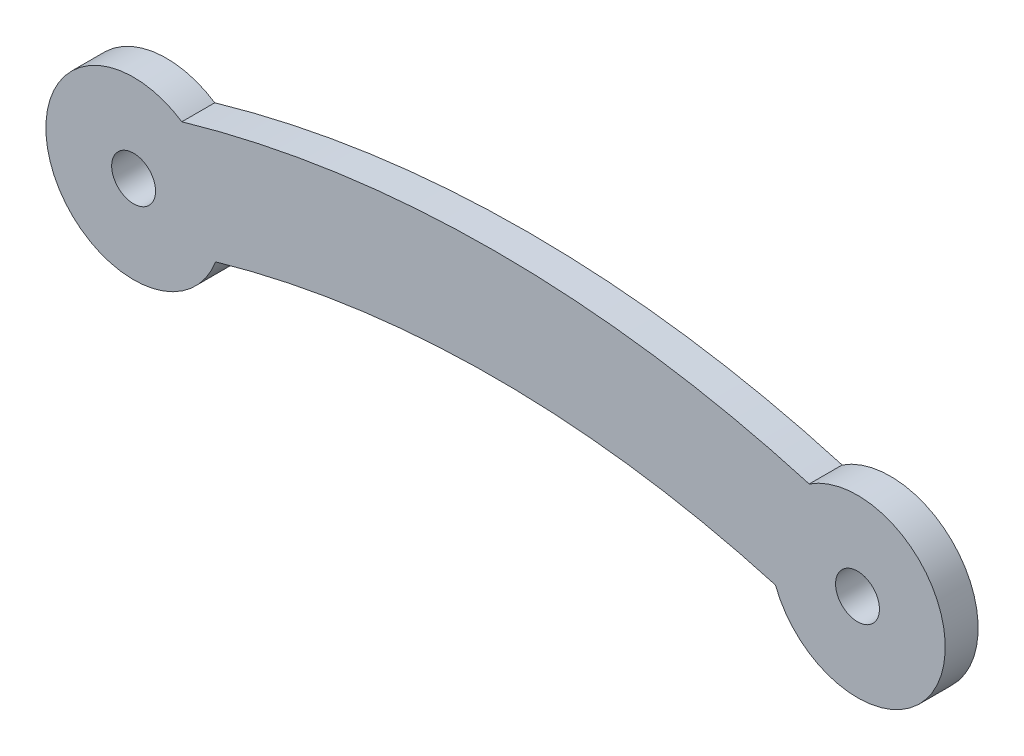
ISO-10303-21;
HEADER;
FILE_DESCRIPTION(('STEP AP214'),'2;1');
FILE_NAME('part.step','',(''),(''),'','','');
FILE_SCHEMA(('AUTOMOTIVE_DESIGN { 1 0 10303 214 1 1 1 1 }'));
ENDSEC;
DATA;
#1=APPLICATION_CONTEXT('core data for automotive mechanical design processes');
#2=APPLICATION_PROTOCOL_DEFINITION('international standard','automotive_design',2000,#1);
#3=PRODUCT_CONTEXT('',#1,'mechanical');
#4=PRODUCT('Part','Part','',(#3));
#5=PRODUCT_RELATED_PRODUCT_CATEGORY('part','',(#4));
#6=PRODUCT_DEFINITION_FORMATION('','',#4);
#7=PRODUCT_DEFINITION_CONTEXT('part definition',#1,'design');
#8=PRODUCT_DEFINITION('design','',#6,#7);
#9=PRODUCT_DEFINITION_SHAPE('','',#8);
#10=(LENGTH_UNIT() NAMED_UNIT(*) SI_UNIT(.MILLI.,.METRE.));
#11=(NAMED_UNIT(*) PLANE_ANGLE_UNIT() SI_UNIT($,.RADIAN.));
#12=(NAMED_UNIT(*) SI_UNIT($,.STERADIAN.) SOLID_ANGLE_UNIT());
#13=UNCERTAINTY_MEASURE_WITH_UNIT(LENGTH_MEASURE(1.E-05),#10,'distance_accuracy_value','');
#14=(GEOMETRIC_REPRESENTATION_CONTEXT(3) GLOBAL_UNCERTAINTY_ASSIGNED_CONTEXT((#13)) GLOBAL_UNIT_ASSIGNED_CONTEXT((#10,
#11,#12)) REPRESENTATION_CONTEXT('',''));
#15=CARTESIAN_POINT('',(0.,0.,0.));
#16=DIRECTION('',(0.,0.,1.));
#17=DIRECTION('',(1.,0.,0.));
#18=AXIS2_PLACEMENT_3D('',#15,#16,#17);
#19=CARTESIAN_POINT('',(24.75,-22.9622545969357,1.5));
#20=DIRECTION('',(0.,0.,-1.));
#21=DIRECTION('',(-1.,0.,0.));
#22=AXIS2_PLACEMENT_3D('',#19,#20,#21);
#23=PLANE('',#22);
#24=CARTESIAN_POINT('',(16.5,-45.9245091938713,1.5));
#25=DIRECTION('',(0.,0.,1.));
#26=DIRECTION('',(-1.,0.,0.));
#27=AXIS2_PLACEMENT_3D('',#24,#25,#26);
#28=CIRCLE('',#27,51.2986735956826);
#29=CARTESIAN_POINT('',(30.8000765160621,3.34070900630672,1.5));
#30=VERTEX_POINT('',#29);
#31=CARTESIAN_POINT('',(2.19992348393783,3.34070900630671,1.5));
#32=VERTEX_POINT('',#31);
#33=EDGE_CURVE('E92',#30,#32,#28,.T.);
#34=ORIENTED_EDGE('',*,*,#33,.T.);
#35=CARTESIAN_POINT('',(0.,0.,1.5));
#36=DIRECTION('',(0.,0.,1.));
#37=DIRECTION('',(1.,0.,0.));
#38=AXIS2_PLACEMENT_3D('',#35,#36,#37);
#39=CIRCLE('',#38,3.99999999999999);
#40=CARTESIAN_POINT('',(3.73986997405074,-1.41893360563263,1.5));
#41=VERTEX_POINT('',#40);
#42=EDGE_CURVE('E87',#32,#41,#39,.T.);
#43=ORIENTED_EDGE('',*,*,#42,.T.);
#44=CARTESIAN_POINT('',(16.5,-45.9245091938713,1.5));
#45=DIRECTION('',(0.,0.,-1.));
#46=DIRECTION('',(-1.,0.,0.));
#47=AXIS2_PLACEMENT_3D('',#44,#45,#46);
#48=CIRCLE('',#47,46.2986735956826);
#49=CARTESIAN_POINT('',(29.2601300259492,-1.41893360563262,1.5));
#50=VERTEX_POINT('',#49);
#51=EDGE_CURVE('E90',#41,#50,#48,.T.);
#52=ORIENTED_EDGE('',*,*,#51,.T.);
#53=CARTESIAN_POINT('',(33.,0.,1.5));
#54=DIRECTION('',(0.,0.,1.));
#55=DIRECTION('',(1.,0.,0.));
#56=AXIS2_PLACEMENT_3D('',#53,#54,#55);
#57=CIRCLE('',#56,4.00000000000006);
#58=EDGE_CURVE('E57',#50,#30,#57,.T.);
#59=ORIENTED_EDGE('',*,*,#58,.T.);
#60=EDGE_LOOP('',(#34,#43,#52,#59));
#61=FACE_BOUND('',#60,.T.);
#62=CARTESIAN_POINT('',(0.,0.,1.5));
#63=DIRECTION('',(0.,0.,1.));
#64=DIRECTION('',(1.,0.,0.));
#65=AXIS2_PLACEMENT_3D('',#62,#63,#64);
#66=CIRCLE('',#65,1.);
#67=CARTESIAN_POINT('',(1.,0.,1.5));
#68=VERTEX_POINT('',#67);
#69=EDGE_CURVE('E112',#68,#68,#66,.T.);
#70=ORIENTED_EDGE('',*,*,#69,.F.);
#71=EDGE_LOOP('',(#70));
#72=FACE_BOUND('',#71,.T.);
#73=CARTESIAN_POINT('',(33.,0.,1.5));
#74=DIRECTION('',(0.,0.,1.));
#75=DIRECTION('',(1.,0.,0.));
#76=AXIS2_PLACEMENT_3D('',#73,#74,#75);
#77=CIRCLE('',#76,0.999999999999998);
#78=CARTESIAN_POINT('',(34.,0.,1.5));
#79=VERTEX_POINT('',#78);
#80=EDGE_CURVE('E134',#79,#79,#77,.T.);
#81=ORIENTED_EDGE('',*,*,#80,.F.);
#82=EDGE_LOOP('',(#81));
#83=FACE_BOUND('',#82,.T.);
#84=ADVANCED_FACE('F39',(#61,#72,#83),#23,.F.);
#85=CARTESIAN_POINT('',(24.75,-22.9622545969357,0.));
#86=DIRECTION('',(0.,0.,-1.));
#87=DIRECTION('',(-1.,0.,0.));
#88=AXIS2_PLACEMENT_3D('',#85,#86,#87);
#89=PLANE('',#88);
#90=CARTESIAN_POINT('',(0.,0.,0.));
#91=DIRECTION('',(0.,0.,1.));
#92=DIRECTION('',(1.,0.,0.));
#93=AXIS2_PLACEMENT_3D('',#90,#91,#92);
#94=CIRCLE('',#93,1.);
#95=CARTESIAN_POINT('',(1.,0.,0.));
#96=VERTEX_POINT('',#95);
#97=EDGE_CURVE('E130',#96,#96,#94,.T.);
#98=ORIENTED_EDGE('',*,*,#97,.T.);
#99=EDGE_LOOP('',(#98));
#100=FACE_BOUND('',#99,.T.);
#101=CARTESIAN_POINT('',(16.5,-45.9245091938713,0.));
#102=DIRECTION('',(0.,0.,1.));
#103=DIRECTION('',(-1.,0.,0.));
#104=AXIS2_PLACEMENT_3D('',#101,#102,#103);
#105=CIRCLE('',#104,51.2986735956826);
#106=CARTESIAN_POINT('',(30.8000765160621,3.34070900630672,0.));
#107=VERTEX_POINT('',#106);
#108=CARTESIAN_POINT('',(2.19992348393783,3.34070900630671,0.));
#109=VERTEX_POINT('',#108);
#110=EDGE_CURVE('E108',#107,#109,#105,.T.);
#111=ORIENTED_EDGE('',*,*,#110,.F.);
#112=CARTESIAN_POINT('',(33.,0.,0.));
#113=DIRECTION('',(0.,0.,1.));
#114=DIRECTION('',(1.,0.,0.));
#115=AXIS2_PLACEMENT_3D('',#112,#113,#114);
#116=CIRCLE('',#115,4.00000000000006);
#117=CARTESIAN_POINT('',(29.2601300259492,-1.41893360563262,0.));
#118=VERTEX_POINT('',#117);
#119=EDGE_CURVE('E80',#118,#107,#116,.T.);
#120=ORIENTED_EDGE('',*,*,#119,.F.);
#121=CARTESIAN_POINT('',(16.5,-45.9245091938713,0.));
#122=DIRECTION('',(0.,0.,-1.));
#123=DIRECTION('',(-1.,0.,0.));
#124=AXIS2_PLACEMENT_3D('',#121,#122,#123);
#125=CIRCLE('',#124,46.2986735956826);
#126=CARTESIAN_POINT('',(3.73986997405074,-1.41893360563263,0.));
#127=VERTEX_POINT('',#126);
#128=EDGE_CURVE('E74',#127,#118,#125,.T.);
#129=ORIENTED_EDGE('',*,*,#128,.F.);
#130=CARTESIAN_POINT('',(0.,0.,0.));
#131=DIRECTION('',(0.,0.,1.));
#132=DIRECTION('',(1.,0.,0.));
#133=AXIS2_PLACEMENT_3D('',#130,#131,#132);
#134=CIRCLE('',#133,3.99999999999999);
#135=EDGE_CURVE('E97',#109,#127,#134,.T.);
#136=ORIENTED_EDGE('',*,*,#135,.F.);
#137=EDGE_LOOP('',(#111,#120,#129,#136));
#138=FACE_BOUND('',#137,.T.);
#139=CARTESIAN_POINT('',(33.,0.,0.));
#140=DIRECTION('',(0.,0.,1.));
#141=DIRECTION('',(1.,0.,0.));
#142=AXIS2_PLACEMENT_3D('',#139,#140,#141);
#143=CIRCLE('',#142,0.999999999999998);
#144=CARTESIAN_POINT('',(34.,0.,0.));
#145=VERTEX_POINT('',#144);
#146=EDGE_CURVE('E138',#145,#145,#143,.T.);
#147=ORIENTED_EDGE('',*,*,#146,.T.);
#148=EDGE_LOOP('',(#147));
#149=FACE_BOUND('',#148,.T.);
#150=ADVANCED_FACE('F125',(#100,#138,#149),#89,.T.);
#151=CARTESIAN_POINT('',(16.5,-45.9245091938713,1.5));
#152=DIRECTION('',(0.,0.,-1.));
#153=DIRECTION('',(-1.,0.,0.));
#154=AXIS2_PLACEMENT_3D('',#151,#152,#153);
#155=CYLINDRICAL_SURFACE('',#154,51.2986735956826);
#156=ORIENTED_EDGE('',*,*,#110,.T.);
#157=DIRECTION('',(0.,0.,-1.));
#158=VECTOR('',#157,1.);
#159=CARTESIAN_POINT('',(2.19992348393783,3.34070900630671,1.5));
#160=LINE('',#159,#158);
#161=EDGE_CURVE('E11',#32,#109,#160,.T.);
#162=ORIENTED_EDGE('',*,*,#161,.F.);
#163=ORIENTED_EDGE('',*,*,#33,.F.);
#164=DIRECTION('',(0.,0.,-1.));
#165=VECTOR('',#164,1.);
#166=CARTESIAN_POINT('',(30.8000765160621,3.34070900630672,1.5));
#167=LINE('',#166,#165);
#168=EDGE_CURVE('E104',#30,#107,#167,.T.);
#169=ORIENTED_EDGE('',*,*,#168,.T.);
#170=EDGE_LOOP('',(#156,#162,#163,#169));
#171=FACE_BOUND('',#170,.T.);
#172=ADVANCED_FACE('F41',(#171),#155,.T.);
#173=CARTESIAN_POINT('',(0.,0.,1.5));
#174=DIRECTION('',(0.,0.,-1.));
#175=DIRECTION('',(-1.,0.,0.));
#176=AXIS2_PLACEMENT_3D('',#173,#174,#175);
#177=CYLINDRICAL_SURFACE('',#176,3.99999999999999);
#178=ORIENTED_EDGE('',*,*,#135,.T.);
#179=DIRECTION('',(0.,0.,-1.));
#180=VECTOR('',#179,1.);
#181=CARTESIAN_POINT('',(3.73986997405074,-1.41893360563263,1.5));
#182=LINE('',#181,#180);
#183=EDGE_CURVE('E49',#41,#127,#182,.T.);
#184=ORIENTED_EDGE('',*,*,#183,.F.);
#185=ORIENTED_EDGE('',*,*,#42,.F.);
#186=ORIENTED_EDGE('',*,*,#161,.T.);
#187=EDGE_LOOP('',(#178,#184,#185,#186));
#188=FACE_BOUND('',#187,.T.);
#189=ADVANCED_FACE('F96',(#188),#177,.T.);
#190=CARTESIAN_POINT('',(16.5,-45.9245091938713,1.5));
#191=DIRECTION('',(0.,0.,-1.));
#192=DIRECTION('',(-1.,0.,0.));
#193=AXIS2_PLACEMENT_3D('',#190,#191,#192);
#194=CYLINDRICAL_SURFACE('',#193,46.2986735956826);
#195=ORIENTED_EDGE('',*,*,#128,.T.);
#196=DIRECTION('',(0.,0.,-1.));
#197=VECTOR('',#196,1.);
#198=CARTESIAN_POINT('',(29.2601300259492,-1.41893360563262,1.5));
#199=LINE('',#198,#197);
#200=EDGE_CURVE('E99',#50,#118,#199,.T.);
#201=ORIENTED_EDGE('',*,*,#200,.F.);
#202=ORIENTED_EDGE('',*,*,#51,.F.);
#203=ORIENTED_EDGE('',*,*,#183,.T.);
#204=EDGE_LOOP('',(#195,#201,#202,#203));
#205=FACE_BOUND('',#204,.T.);
#206=ADVANCED_FACE('F100',(#205),#194,.F.);
#207=CARTESIAN_POINT('',(33.,0.,1.5));
#208=DIRECTION('',(0.,0.,-1.));
#209=DIRECTION('',(-1.,0.,0.));
#210=AXIS2_PLACEMENT_3D('',#207,#208,#209);
#211=CYLINDRICAL_SURFACE('',#210,4.00000000000006);
#212=ORIENTED_EDGE('',*,*,#119,.T.);
#213=ORIENTED_EDGE('',*,*,#168,.F.);
#214=ORIENTED_EDGE('',*,*,#58,.F.);
#215=ORIENTED_EDGE('',*,*,#200,.T.);
#216=EDGE_LOOP('',(#212,#213,#214,#215));
#217=FACE_BOUND('',#216,.T.);
#218=ADVANCED_FACE('F122',(#217),#211,.T.);
#219=CARTESIAN_POINT('',(0.,0.,1.5));
#220=DIRECTION('',(0.,0.,-1.));
#221=DIRECTION('',(-1.,0.,0.));
#222=AXIS2_PLACEMENT_3D('',#219,#220,#221);
#223=CYLINDRICAL_SURFACE('',#222,1.);
#224=ORIENTED_EDGE('',*,*,#69,.T.);
#225=EDGE_LOOP('',(#224));
#226=FACE_BOUND('',#225,.T.);
#227=ORIENTED_EDGE('',*,*,#97,.F.);
#228=EDGE_LOOP('',(#227));
#229=FACE_BOUND('',#228,.T.);
#230=ADVANCED_FACE('F157',(#226,#229),#223,.F.);
#231=CARTESIAN_POINT('',(33.,0.,1.5));
#232=DIRECTION('',(0.,0.,-1.));
#233=DIRECTION('',(-1.,0.,0.));
#234=AXIS2_PLACEMENT_3D('',#231,#232,#233);
#235=CYLINDRICAL_SURFACE('',#234,0.999999999999998);
#236=ORIENTED_EDGE('',*,*,#80,.T.);
#237=EDGE_LOOP('',(#236));
#238=FACE_BOUND('',#237,.T.);
#239=ORIENTED_EDGE('',*,*,#146,.F.);
#240=EDGE_LOOP('',(#239));
#241=FACE_BOUND('',#240,.T.);
#242=ADVANCED_FACE('F146',(#238,#241),#235,.F.);
#243=CLOSED_SHELL('',(#84,#150,#172,#189,#206,#218,#230,#242));
#244=MANIFOLD_SOLID_BREP('B2',#243);
#245=ADVANCED_BREP_SHAPE_REPRESENTATION('',(#18,#244),#14);
#246=SHAPE_DEFINITION_REPRESENTATION(#9,#245);
ENDSEC;
END-ISO-10303-21;
